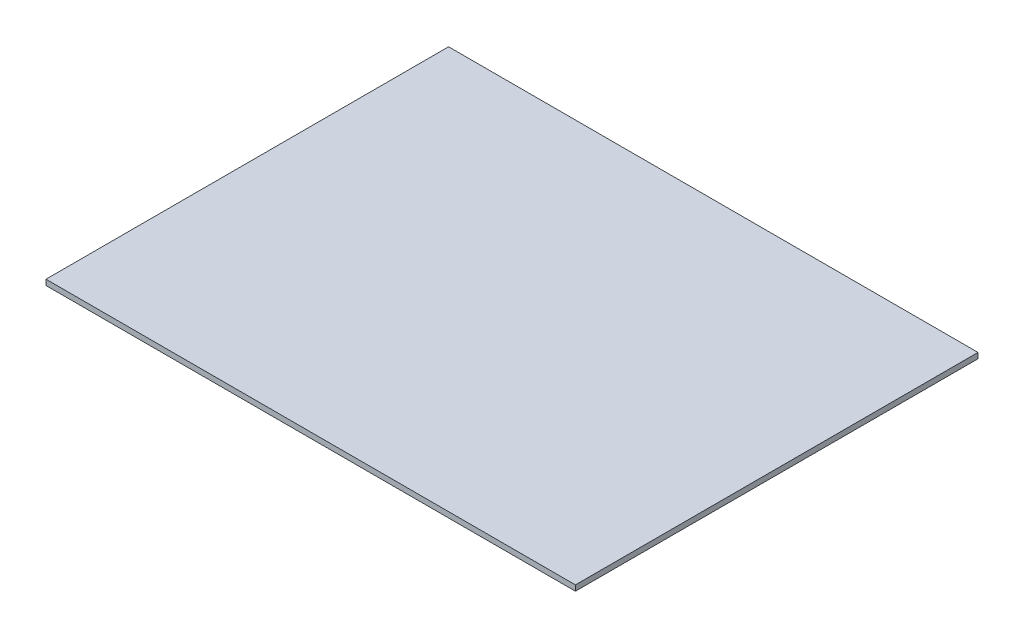
ISO-10303-21;
HEADER;
FILE_DESCRIPTION(('STEP AP214'),'2;1');
FILE_NAME('part.step','',(''),(''),'','','');
FILE_SCHEMA(('AUTOMOTIVE_DESIGN { 1 0 10303 214 1 1 1 1 }'));
ENDSEC;
DATA;
#1=APPLICATION_CONTEXT('core data for automotive mechanical design processes');
#2=APPLICATION_PROTOCOL_DEFINITION('international standard','automotive_design',2000,#1);
#3=PRODUCT_CONTEXT('',#1,'mechanical');
#4=PRODUCT('Part','Part','',(#3));
#5=PRODUCT_RELATED_PRODUCT_CATEGORY('part','',(#4));
#6=PRODUCT_DEFINITION_FORMATION('','',#4);
#7=PRODUCT_DEFINITION_CONTEXT('part definition',#1,'design');
#8=PRODUCT_DEFINITION('design','',#6,#7);
#9=PRODUCT_DEFINITION_SHAPE('','',#8);
#10=(LENGTH_UNIT() NAMED_UNIT(*) SI_UNIT(.MILLI.,.METRE.));
#11=(NAMED_UNIT(*) PLANE_ANGLE_UNIT() SI_UNIT($,.RADIAN.));
#12=(NAMED_UNIT(*) SI_UNIT($,.STERADIAN.) SOLID_ANGLE_UNIT());
#13=UNCERTAINTY_MEASURE_WITH_UNIT(LENGTH_MEASURE(1.E-05),#10,'distance_accuracy_value','');
#14=(GEOMETRIC_REPRESENTATION_CONTEXT(3) GLOBAL_UNCERTAINTY_ASSIGNED_CONTEXT((#13)) GLOBAL_UNIT_ASSIGNED_CONTEXT((#10,
#11,#12)) REPRESENTATION_CONTEXT('',''));
#15=CARTESIAN_POINT('',(0.,0.,0.));
#16=DIRECTION('',(0.,0.,1.));
#17=DIRECTION('',(1.,0.,0.));
#18=AXIS2_PLACEMENT_3D('',#15,#16,#17);
#19=CARTESIAN_POINT('',(-243.84,2.54,-99.0051234567901));
#20=DIRECTION('',(1.,0.,0.));
#21=DIRECTION('',(0.,0.,-1.));
#22=AXIS2_PLACEMENT_3D('',#19,#20,#21);
#23=PLANE('',#22);
#24=DIRECTION('',(0.,0.,1.));
#25=VECTOR('',#24,1.);
#26=CARTESIAN_POINT('',(-243.84,0.,-99.0051234567901));
#27=LINE('',#26,#25);
#28=CARTESIAN_POINT('',(-243.84,0.,-99.0051234567901));
#29=VERTEX_POINT('',#28);
#30=CARTESIAN_POINT('',(-243.84,0.,86.4148765432099));
#31=VERTEX_POINT('',#30);
#32=EDGE_CURVE('E107',#29,#31,#27,.T.);
#33=ORIENTED_EDGE('',*,*,#32,.T.);
#34=DIRECTION('',(0.,-1.,0.));
#35=VECTOR('',#34,1.);
#36=CARTESIAN_POINT('',(-243.84,2.54,86.4148765432099));
#37=LINE('',#36,#35);
#38=CARTESIAN_POINT('',(-243.84,2.54,86.4148765432099));
#39=VERTEX_POINT('',#38);
#40=EDGE_CURVE('E11',#39,#31,#37,.T.);
#41=ORIENTED_EDGE('',*,*,#40,.F.);
#42=DIRECTION('',(0.,0.,1.));
#43=VECTOR('',#42,1.);
#44=CARTESIAN_POINT('',(-243.84,2.54,-99.0051234567901));
#45=LINE('',#44,#43);
#46=CARTESIAN_POINT('',(-243.84,2.54,-99.0051234567901));
#47=VERTEX_POINT('',#46);
#48=EDGE_CURVE('E91',#47,#39,#45,.T.);
#49=ORIENTED_EDGE('',*,*,#48,.F.);
#50=DIRECTION('',(0.,-1.,0.));
#51=VECTOR('',#50,1.);
#52=CARTESIAN_POINT('',(-243.84,2.54,-99.0051234567901));
#53=LINE('',#52,#51);
#54=EDGE_CURVE('E103',#47,#29,#53,.T.);
#55=ORIENTED_EDGE('',*,*,#54,.T.);
#56=EDGE_LOOP('',(#33,#41,#49,#55));
#57=FACE_BOUND('',#56,.T.);
#58=ADVANCED_FACE('F39',(#57),#23,.F.);
#59=CARTESIAN_POINT('',(-243.84,2.54,86.4148765432099));
#60=DIRECTION('',(0.,0.,-1.));
#61=DIRECTION('',(-1.,0.,0.));
#62=AXIS2_PLACEMENT_3D('',#59,#60,#61);
#63=PLANE('',#62);
#64=DIRECTION('',(1.,0.,0.));
#65=VECTOR('',#64,1.);
#66=CARTESIAN_POINT('',(-243.84,0.,86.4148765432099));
#67=LINE('',#66,#65);
#68=CARTESIAN_POINT('',(0.,0.,86.4148765432099));
#69=VERTEX_POINT('',#68);
#70=EDGE_CURVE('E96',#31,#69,#67,.T.);
#71=ORIENTED_EDGE('',*,*,#70,.T.);
#72=DIRECTION('',(0.,-1.,0.));
#73=VECTOR('',#72,1.);
#74=CARTESIAN_POINT('',(0.,2.54,86.4148765432099));
#75=LINE('',#74,#73);
#76=CARTESIAN_POINT('',(0.,2.54,86.4148765432099));
#77=VERTEX_POINT('',#76);
#78=EDGE_CURVE('E48',#77,#69,#75,.T.);
#79=ORIENTED_EDGE('',*,*,#78,.F.);
#80=DIRECTION('',(1.,0.,0.));
#81=VECTOR('',#80,1.);
#82=CARTESIAN_POINT('',(-243.84,2.54,86.4148765432099));
#83=LINE('',#82,#81);
#84=EDGE_CURVE('E86',#39,#77,#83,.T.);
#85=ORIENTED_EDGE('',*,*,#84,.F.);
#86=ORIENTED_EDGE('',*,*,#40,.T.);
#87=EDGE_LOOP('',(#71,#79,#85,#86));
#88=FACE_BOUND('',#87,.T.);
#89=ADVANCED_FACE('F95',(#88),#63,.F.);
#90=CARTESIAN_POINT('',(0.,2.54,-99.0051234567901));
#91=DIRECTION('',(-1.,0.,0.));
#92=DIRECTION('',(0.,0.,1.));
#93=AXIS2_PLACEMENT_3D('',#90,#91,#92);
#94=PLANE('',#93);
#95=DIRECTION('',(0.,0.,-1.));
#96=VECTOR('',#95,1.);
#97=CARTESIAN_POINT('',(0.,0.,-99.0051234567901));
#98=LINE('',#97,#96);
#99=CARTESIAN_POINT('',(0.,0.,-99.0051234567901));
#100=VERTEX_POINT('',#99);
#101=EDGE_CURVE('E73',#69,#100,#98,.T.);
#102=ORIENTED_EDGE('',*,*,#101,.T.);
#103=DIRECTION('',(0.,-1.,0.));
#104=VECTOR('',#103,1.);
#105=CARTESIAN_POINT('',(0.,2.54,-99.0051234567901));
#106=LINE('',#105,#104);
#107=CARTESIAN_POINT('',(0.,2.54,-99.0051234567901));
#108=VERTEX_POINT('',#107);
#109=EDGE_CURVE('E98',#108,#100,#106,.T.);
#110=ORIENTED_EDGE('',*,*,#109,.F.);
#111=DIRECTION('',(0.,0.,-1.));
#112=VECTOR('',#111,1.);
#113=CARTESIAN_POINT('',(0.,2.54,-99.0051234567901));
#114=LINE('',#113,#112);
#115=EDGE_CURVE('E89',#77,#108,#114,.T.);
#116=ORIENTED_EDGE('',*,*,#115,.F.);
#117=ORIENTED_EDGE('',*,*,#78,.T.);
#118=EDGE_LOOP('',(#102,#110,#116,#117));
#119=FACE_BOUND('',#118,.T.);
#120=ADVANCED_FACE('F99',(#119),#94,.F.);
#121=CARTESIAN_POINT('',(-243.84,2.54,-99.0051234567901));
#122=DIRECTION('',(0.,0.,1.));
#123=DIRECTION('',(1.,0.,0.));
#124=AXIS2_PLACEMENT_3D('',#121,#122,#123);
#125=PLANE('',#124);
#126=DIRECTION('',(-1.,0.,0.));
#127=VECTOR('',#126,1.);
#128=CARTESIAN_POINT('',(-243.84,0.,-99.0051234567901));
#129=LINE('',#128,#127);
#130=EDGE_CURVE('E79',#100,#29,#129,.T.);
#131=ORIENTED_EDGE('',*,*,#130,.T.);
#132=ORIENTED_EDGE('',*,*,#54,.F.);
#133=DIRECTION('',(-1.,0.,0.));
#134=VECTOR('',#133,1.);
#135=CARTESIAN_POINT('',(-243.84,2.54,-99.0051234567901));
#136=LINE('',#135,#134);
#137=EDGE_CURVE('E56',#108,#47,#136,.T.);
#138=ORIENTED_EDGE('',*,*,#137,.F.);
#139=ORIENTED_EDGE('',*,*,#109,.T.);
#140=EDGE_LOOP('',(#131,#132,#138,#139));
#141=FACE_BOUND('',#140,.T.);
#142=ADVANCED_FACE('F120',(#141),#125,.F.);
#143=CARTESIAN_POINT('',(0.,2.54,0.));
#144=DIRECTION('',(0.,1.,0.));
#145=DIRECTION('',(0.,0.,1.));
#146=AXIS2_PLACEMENT_3D('',#143,#144,#145);
#147=PLANE('',#146);
#148=ORIENTED_EDGE('',*,*,#48,.T.);
#149=ORIENTED_EDGE('',*,*,#84,.T.);
#150=ORIENTED_EDGE('',*,*,#115,.T.);
#151=ORIENTED_EDGE('',*,*,#137,.T.);
#152=EDGE_LOOP('',(#148,#149,#150,#151));
#153=FACE_BOUND('',#152,.T.);
#154=ADVANCED_FACE('F87',(#153),#147,.T.);
#155=CARTESIAN_POINT('',(0.,0.,0.));
#156=DIRECTION('',(0.,1.,0.));
#157=DIRECTION('',(0.,0.,1.));
#158=AXIS2_PLACEMENT_3D('',#155,#156,#157);
#159=PLANE('',#158);
#160=ORIENTED_EDGE('',*,*,#32,.F.);
#161=ORIENTED_EDGE('',*,*,#130,.F.);
#162=ORIENTED_EDGE('',*,*,#101,.F.);
#163=ORIENTED_EDGE('',*,*,#70,.F.);
#164=EDGE_LOOP('',(#160,#161,#162,#163));
#165=FACE_BOUND('',#164,.T.);
#166=ADVANCED_FACE('F123',(#165),#159,.F.);
#167=CLOSED_SHELL('',(#58,#89,#120,#142,#154,#166));
#168=MANIFOLD_SOLID_BREP('B2',#167);
#169=ADVANCED_BREP_SHAPE_REPRESENTATION('',(#18,#168),#14);
#170=SHAPE_DEFINITION_REPRESENTATION(#9,#169);
ENDSEC;
END-ISO-10303-21;
